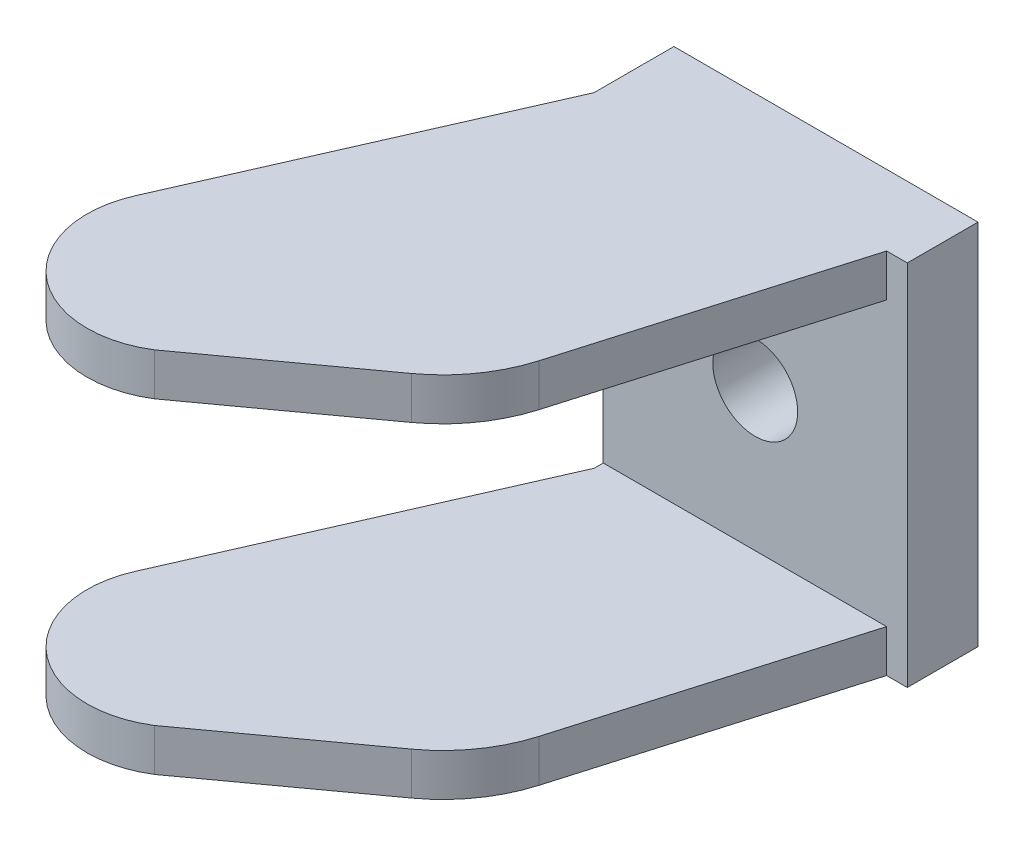
ISO-10303-21;
HEADER;
FILE_DESCRIPTION(('STEP AP214'),'2;1');
FILE_NAME('part.step','',(''),(''),'','','');
FILE_SCHEMA(('AUTOMOTIVE_DESIGN { 1 0 10303 214 1 1 1 1 }'));
ENDSEC;
DATA;
#1=APPLICATION_CONTEXT('core data for automotive mechanical design processes');
#2=APPLICATION_PROTOCOL_DEFINITION('international standard','automotive_design',2000,#1);
#3=PRODUCT_CONTEXT('',#1,'mechanical');
#4=PRODUCT('Part','Part','',(#3));
#5=PRODUCT_RELATED_PRODUCT_CATEGORY('part','',(#4));
#6=PRODUCT_DEFINITION_FORMATION('','',#4);
#7=PRODUCT_DEFINITION_CONTEXT('part definition',#1,'design');
#8=PRODUCT_DEFINITION('design','',#6,#7);
#9=PRODUCT_DEFINITION_SHAPE('','',#8);
#10=(LENGTH_UNIT() NAMED_UNIT(*) SI_UNIT(.MILLI.,.METRE.));
#11=(NAMED_UNIT(*) PLANE_ANGLE_UNIT() SI_UNIT($,.RADIAN.));
#12=(NAMED_UNIT(*) SI_UNIT($,.STERADIAN.) SOLID_ANGLE_UNIT());
#13=UNCERTAINTY_MEASURE_WITH_UNIT(LENGTH_MEASURE(1.E-05),#10,'distance_accuracy_value','');
#14=(GEOMETRIC_REPRESENTATION_CONTEXT(3) GLOBAL_UNCERTAINTY_ASSIGNED_CONTEXT((#13)) GLOBAL_UNIT_ASSIGNED_CONTEXT((#10,
#11,#12)) REPRESENTATION_CONTEXT('',''));
#15=CARTESIAN_POINT('',(0.,0.,0.));
#16=DIRECTION('',(0.,0.,1.));
#17=DIRECTION('',(1.,0.,0.));
#18=AXIS2_PLACEMENT_3D('',#15,#16,#17);
#19=CARTESIAN_POINT('',(0.,0.,5.));
#20=DIRECTION('',(0.,0.,-1.));
#21=DIRECTION('',(-1.,0.,0.));
#22=AXIS2_PLACEMENT_3D('',#19,#20,#21);
#23=PLANE('',#22);
#24=CARTESIAN_POINT('',(10.75,0.,5.));
#25=DIRECTION('',(0.,0.,-1.));
#26=DIRECTION('',(-1.,0.,0.));
#27=AXIS2_PLACEMENT_3D('',#24,#25,#26);
#28=CIRCLE('',#27,3.);
#29=CARTESIAN_POINT('',(7.75,0.,5.));
#30=VERTEX_POINT('',#29);
#31=EDGE_CURVE('E153',#30,#30,#28,.T.);
#32=ORIENTED_EDGE('',*,*,#31,.T.);
#33=EDGE_LOOP('',(#32));
#34=FACE_BOUND('',#33,.T.);
#35=DIRECTION('',(0.,1.,0.));
#36=VECTOR('',#35,1.);
#37=CARTESIAN_POINT('',(20.0357289784233,0.,5.));
#38=LINE('',#37,#36);
#39=CARTESIAN_POINT('',(20.0357289784233,10.,5.));
#40=VERTEX_POINT('',#39);
#41=CARTESIAN_POINT('',(20.0357289784233,13.,5.));
#42=VERTEX_POINT('',#41);
#43=EDGE_CURVE('E166',#40,#42,#38,.T.);
#44=ORIENTED_EDGE('',*,*,#43,.F.);
#45=DIRECTION('',(-1.,0.,0.));
#46=VECTOR('',#45,1.);
#47=CARTESIAN_POINT('',(0.,10.,5.));
#48=LINE('',#47,#46);
#49=CARTESIAN_POINT('',(0.,9.99999999999999,5.));
#50=VERTEX_POINT('',#49);
#51=EDGE_CURVE('E169',#40,#50,#48,.T.);
#52=ORIENTED_EDGE('',*,*,#51,.T.);
#53=DIRECTION('',(0.,1.,0.));
#54=VECTOR('',#53,1.);
#55=CARTESIAN_POINT('',(0.,-13.,5.));
#56=LINE('',#55,#54);
#57=CARTESIAN_POINT('',(0.,-10.,5.));
#58=VERTEX_POINT('',#57);
#59=EDGE_CURVE('E151',#58,#50,#56,.T.);
#60=ORIENTED_EDGE('',*,*,#59,.F.);
#61=DIRECTION('',(1.,0.,0.));
#62=VECTOR('',#61,1.);
#63=CARTESIAN_POINT('',(4.87079094798598,-10.,5.));
#64=LINE('',#63,#62);
#65=CARTESIAN_POINT('',(20.0357289784233,-10.,5.));
#66=VERTEX_POINT('',#65);
#67=EDGE_CURVE('E11',#58,#66,#64,.T.);
#68=ORIENTED_EDGE('',*,*,#67,.T.);
#69=DIRECTION('',(0.,-1.,0.));
#70=VECTOR('',#69,1.);
#71=CARTESIAN_POINT('',(20.0357289784233,13.,5.));
#72=LINE('',#71,#70);
#73=CARTESIAN_POINT('',(20.0357289784233,-13.,5.));
#74=VERTEX_POINT('',#73);
#75=EDGE_CURVE('E192',#66,#74,#72,.T.);
#76=ORIENTED_EDGE('',*,*,#75,.T.);
#77=DIRECTION('',(-1.,0.,0.));
#78=VECTOR('',#77,1.);
#79=CARTESIAN_POINT('',(0.,-13.,5.));
#80=LINE('',#79,#78);
#81=CARTESIAN_POINT('',(21.5,-13.,5.));
#82=VERTEX_POINT('',#81);
#83=EDGE_CURVE('E183',#82,#74,#80,.T.);
#84=ORIENTED_EDGE('',*,*,#83,.F.);
#85=DIRECTION('',(0.,-1.,0.));
#86=VECTOR('',#85,1.);
#87=CARTESIAN_POINT('',(21.5,-13.,5.));
#88=LINE('',#87,#86);
#89=CARTESIAN_POINT('',(21.5,13.,5.));
#90=VERTEX_POINT('',#89);
#91=EDGE_CURVE('E180',#90,#82,#88,.T.);
#92=ORIENTED_EDGE('',*,*,#91,.F.);
#93=DIRECTION('',(1.,0.,0.));
#94=VECTOR('',#93,1.);
#95=CARTESIAN_POINT('',(0.,13.,5.));
#96=LINE('',#95,#94);
#97=EDGE_CURVE('E178',#42,#90,#96,.T.);
#98=ORIENTED_EDGE('',*,*,#97,.F.);
#99=EDGE_LOOP('',(#44,#52,#60,#68,#76,#84,#92,#98));
#100=FACE_BOUND('',#99,.T.);
#101=ADVANCED_FACE('F33',(#34,#100),#23,.F.);
#102=CARTESIAN_POINT('',(21.5,13.,0.));
#103=DIRECTION('',(-0.959693081685754,0.,-0.281050153824011));
#104=DIRECTION('',(-0.281050153824011,0.,0.959693081685754));
#105=AXIS2_PLACEMENT_3D('',#102,#103,#104);
#106=PLANE('',#105);
#107=ORIENTED_EDGE('',*,*,#75,.F.);
#108=DIRECTION('',(0.281050153824011,0.,-0.959693081685754));
#109=VECTOR('',#108,1.);
#110=CARTESIAN_POINT('',(21.5,-10.,0.));
#111=LINE('',#110,#109);
#112=CARTESIAN_POINT('',(14.4677217648435,-10.,24.0128983348466));
#113=VERTEX_POINT('',#112);
#114=EDGE_CURVE('E41',#113,#66,#111,.T.);
#115=ORIENTED_EDGE('',*,*,#114,.F.);
#116=DIRECTION('',(0.,-1.,0.));
#117=VECTOR('',#116,1.);
#118=CARTESIAN_POINT('',(14.4677217648435,13.,24.0128983348466));
#119=LINE('',#118,#117);
#120=CARTESIAN_POINT('',(14.4677217648435,-13.,24.0128983348466));
#121=VERTEX_POINT('',#120);
#122=EDGE_CURVE('E205',#113,#121,#119,.T.);
#123=ORIENTED_EDGE('',*,*,#122,.T.);
#124=DIRECTION('',(0.281050153824011,0.,-0.959693081685754));
#125=VECTOR('',#124,1.);
#126=CARTESIAN_POINT('',(21.5,-13.,0.));
#127=LINE('',#126,#125);
#128=EDGE_CURVE('E56',#121,#74,#127,.T.);
#129=ORIENTED_EDGE('',*,*,#128,.T.);
#130=EDGE_LOOP('',(#107,#115,#123,#129));
#131=FACE_BOUND('',#130,.T.);
#132=ADVANCED_FACE('F325',(#131),#106,.F.);
#133=CARTESIAN_POINT('',(4.87079094798598,-10.,21.2023967966065));
#134=DIRECTION('',(0.,-1.,0.));
#135=DIRECTION('',(0.,0.,-1.));
#136=AXIS2_PLACEMENT_3D('',#133,#134,#135);
#137=PLANE('',#136);
#138=ORIENTED_EDGE('',*,*,#67,.F.);
#139=DIRECTION('',(0.,0.,1.));
#140=VECTOR('',#139,1.);
#141=CARTESIAN_POINT('',(0.,-10.,5.6494442047383));
#142=LINE('',#141,#140);
#143=CARTESIAN_POINT('',(0.,-10.,5.6494442047383));
#144=VERTEX_POINT('',#143);
#145=EDGE_CURVE('E202',#58,#144,#142,.T.);
#146=ORIENTED_EDGE('',*,*,#145,.T.);
#147=DIRECTION('',(-0.402513806205411,0.,0.915413915020977));
#148=VECTOR('',#147,1.);
#149=CARTESIAN_POINT('',(-9.90789740514684,-10.,28.1824033565621));
#150=LINE('',#149,#148);
#151=CARTESIAN_POINT('',(-9.90789740514684,-10.,28.1824033565621));
#152=VERTEX_POINT('',#151);
#153=EDGE_CURVE('E232',#144,#152,#150,.T.);
#154=ORIENTED_EDGE('',*,*,#153,.T.);
#155=CARTESIAN_POINT('',(-3.5,-10.,31.));
#156=DIRECTION('',(0.,1.,0.));
#157=DIRECTION('',(0.,0.,1.));
#158=AXIS2_PLACEMENT_3D('',#155,#156,#157);
#159=CIRCLE('',#158,7.);
#160=CARTESIAN_POINT('',(0.209992580022254,-10.,36.9359881280356));
#161=VERTEX_POINT('',#160);
#162=EDGE_CURVE('E230',#152,#161,#159,.T.);
#163=ORIENTED_EDGE('',*,*,#162,.T.);
#164=DIRECTION('',(0.80950474651875,0.,-0.587113332639972));
#165=VECTOR('',#164,1.);
#166=CARTESIAN_POINT('',(10.7419242743857,-10.,29.297444261794));
#167=LINE('',#166,#165);
#168=CARTESIAN_POINT('',(10.7419242743857,-10.,29.297444261794));
#169=VERTEX_POINT('',#168);
#170=EDGE_CURVE('E228',#161,#169,#167,.T.);
#171=ORIENTED_EDGE('',*,*,#170,.T.);
#172=CARTESIAN_POINT('',(4.87079094798598,-10.,21.2023967966065));
#173=DIRECTION('',(0.,1.,0.));
#174=DIRECTION('',(0.,0.,-1.));
#175=AXIS2_PLACEMENT_3D('',#172,#173,#174);
#176=CIRCLE('',#175,10.);
#177=EDGE_CURVE('E226',#169,#113,#176,.T.);
#178=ORIENTED_EDGE('',*,*,#177,.T.);
#179=ORIENTED_EDGE('',*,*,#114,.T.);
#180=EDGE_LOOP('',(#138,#146,#154,#163,#171,#178,#179));
#181=FACE_BOUND('',#180,.T.);
#182=ADVANCED_FACE('F332',(#181),#137,.F.);
#183=CARTESIAN_POINT('',(0.,13.,5.6494442047383));
#184=DIRECTION('',(1.,0.,0.));
#185=DIRECTION('',(0.,0.,-1.));
#186=AXIS2_PLACEMENT_3D('',#183,#184,#185);
#187=PLANE('',#186);
#188=ORIENTED_EDGE('',*,*,#59,.T.);
#189=DIRECTION('',(0.,0.,1.));
#190=VECTOR('',#189,1.);
#191=CARTESIAN_POINT('',(0.,10.,5.6494442047383));
#192=LINE('',#191,#190);
#193=CARTESIAN_POINT('',(0.,10.,5.6494442047383));
#194=VERTEX_POINT('',#193);
#195=EDGE_CURVE('E48',#50,#194,#192,.T.);
#196=ORIENTED_EDGE('',*,*,#195,.T.);
#197=DIRECTION('',(0.,-1.,0.));
#198=VECTOR('',#197,1.);
#199=CARTESIAN_POINT('',(0.,13.,5.6494442047383));
#200=LINE('',#199,#198);
#201=CARTESIAN_POINT('',(0.,13.,5.6494442047383));
#202=VERTEX_POINT('',#201);
#203=EDGE_CURVE('E148',#202,#194,#200,.T.);
#204=ORIENTED_EDGE('',*,*,#203,.F.);
#205=DIRECTION('',(0.,0.,-1.));
#206=VECTOR('',#205,1.);
#207=CARTESIAN_POINT('',(0.,13.,5.));
#208=LINE('',#207,#206);
#209=CARTESIAN_POINT('',(0.,13.,0.));
#210=VERTEX_POINT('',#209);
#211=EDGE_CURVE('E186',#202,#210,#208,.T.);
#212=ORIENTED_EDGE('',*,*,#211,.T.);
#213=DIRECTION('',(0.,-1.,0.));
#214=VECTOR('',#213,1.);
#215=CARTESIAN_POINT('',(0.,13.,0.));
#216=LINE('',#215,#214);
#217=CARTESIAN_POINT('',(0.,-13.,0.));
#218=VERTEX_POINT('',#217);
#219=EDGE_CURVE('E198',#210,#218,#216,.T.);
#220=ORIENTED_EDGE('',*,*,#219,.T.);
#221=DIRECTION('',(0.,0.,1.));
#222=VECTOR('',#221,1.);
#223=CARTESIAN_POINT('',(0.,-13.,5.6494442047383));
#224=LINE('',#223,#222);
#225=CARTESIAN_POINT('',(0.,-13.,5.6494442047383));
#226=VERTEX_POINT('',#225);
#227=EDGE_CURVE('E222',#218,#226,#224,.T.);
#228=ORIENTED_EDGE('',*,*,#227,.T.);
#229=DIRECTION('',(0.,-1.,0.));
#230=VECTOR('',#229,1.);
#231=CARTESIAN_POINT('',(0.,13.,5.6494442047383));
#232=LINE('',#231,#230);
#233=EDGE_CURVE('E221',#144,#226,#232,.T.);
#234=ORIENTED_EDGE('',*,*,#233,.F.);
#235=ORIENTED_EDGE('',*,*,#145,.F.);
#236=EDGE_LOOP('',(#188,#196,#204,#212,#220,#228,#234,#235));
#237=FACE_BOUND('',#236,.T.);
#238=ADVANCED_FACE('F35',(#237),#187,.F.);
#239=CARTESIAN_POINT('',(-9.90789740514684,13.,28.1824033565621));
#240=DIRECTION('',(0.915413915020977,0.,0.402513806205411));
#241=DIRECTION('',(0.402513806205411,0.,-0.915413915020977));
#242=AXIS2_PLACEMENT_3D('',#239,#240,#241);
#243=PLANE('',#242);
#244=DIRECTION('',(0.,-1.,0.));
#245=VECTOR('',#244,1.);
#246=CARTESIAN_POINT('',(-9.90789740514684,13.,28.1824033565621));
#247=LINE('',#246,#245);
#248=CARTESIAN_POINT('',(-9.90789740514684,-13.,28.1824033565621));
#249=VERTEX_POINT('',#248);
#250=EDGE_CURVE('E217',#152,#249,#247,.T.);
#251=ORIENTED_EDGE('',*,*,#250,.F.);
#252=ORIENTED_EDGE('',*,*,#153,.F.);
#253=ORIENTED_EDGE('',*,*,#233,.T.);
#254=DIRECTION('',(-0.402513806205411,0.,0.915413915020977));
#255=VECTOR('',#254,1.);
#256=CARTESIAN_POINT('',(-9.90789740514684,-13.,28.1824033565621));
#257=LINE('',#256,#255);
#258=EDGE_CURVE('E218',#226,#249,#257,.T.);
#259=ORIENTED_EDGE('',*,*,#258,.T.);
#260=EDGE_LOOP('',(#251,#252,#253,#259));
#261=FACE_BOUND('',#260,.T.);
#262=ADVANCED_FACE('F254',(#261),#243,.F.);
#263=CARTESIAN_POINT('',(-3.5,13.,31.));
#264=DIRECTION('',(0.,-1.,0.));
#265=DIRECTION('',(0.,0.,-1.));
#266=AXIS2_PLACEMENT_3D('',#263,#264,#265);
#267=CYLINDRICAL_SURFACE('',#266,7.);
#268=DIRECTION('',(0.,-1.,0.));
#269=VECTOR('',#268,1.);
#270=CARTESIAN_POINT('',(0.209992580022254,13.,36.9359881280356));
#271=LINE('',#270,#269);
#272=CARTESIAN_POINT('',(0.209992580022254,-13.,36.9359881280356));
#273=VERTEX_POINT('',#272);
#274=EDGE_CURVE('E213',#161,#273,#271,.T.);
#275=ORIENTED_EDGE('',*,*,#274,.F.);
#276=ORIENTED_EDGE('',*,*,#162,.F.);
#277=ORIENTED_EDGE('',*,*,#250,.T.);
#278=CARTESIAN_POINT('',(-3.5,-13.,31.));
#279=DIRECTION('',(0.,1.,0.));
#280=DIRECTION('',(0.,0.,1.));
#281=AXIS2_PLACEMENT_3D('',#278,#279,#280);
#282=CIRCLE('',#281,7.);
#283=EDGE_CURVE('E214',#249,#273,#282,.T.);
#284=ORIENTED_EDGE('',*,*,#283,.T.);
#285=EDGE_LOOP('',(#275,#276,#277,#284));
#286=FACE_BOUND('',#285,.T.);
#287=ADVANCED_FACE('F471',(#286),#267,.T.);
#288=CARTESIAN_POINT('',(10.7419242743857,13.,29.297444261794));
#289=DIRECTION('',(-0.587113332639972,0.,-0.80950474651875));
#290=DIRECTION('',(-0.80950474651875,0.,0.587113332639972));
#291=AXIS2_PLACEMENT_3D('',#288,#289,#290);
#292=PLANE('',#291);
#293=DIRECTION('',(0.,-1.,0.));
#294=VECTOR('',#293,1.);
#295=CARTESIAN_POINT('',(10.7419242743857,13.,29.297444261794));
#296=LINE('',#295,#294);
#297=CARTESIAN_POINT('',(10.7419242743857,-13.,29.297444261794));
#298=VERTEX_POINT('',#297);
#299=EDGE_CURVE('E209',#169,#298,#296,.T.);
#300=ORIENTED_EDGE('',*,*,#299,.F.);
#301=ORIENTED_EDGE('',*,*,#170,.F.);
#302=ORIENTED_EDGE('',*,*,#274,.T.);
#303=DIRECTION('',(0.80950474651875,0.,-0.587113332639972));
#304=VECTOR('',#303,1.);
#305=CARTESIAN_POINT('',(10.7419242743857,-13.,29.297444261794));
#306=LINE('',#305,#304);
#307=EDGE_CURVE('E210',#273,#298,#306,.T.);
#308=ORIENTED_EDGE('',*,*,#307,.T.);
#309=EDGE_LOOP('',(#300,#301,#302,#308));
#310=FACE_BOUND('',#309,.T.);
#311=ADVANCED_FACE('F320',(#310),#292,.F.);
#312=CARTESIAN_POINT('',(4.87079094798598,13.,21.2023967966065));
#313=DIRECTION('',(0.,-1.,0.));
#314=DIRECTION('',(0.,0.,-1.));
#315=AXIS2_PLACEMENT_3D('',#312,#313,#314);
#316=CYLINDRICAL_SURFACE('',#315,10.);
#317=ORIENTED_EDGE('',*,*,#122,.F.);
#318=ORIENTED_EDGE('',*,*,#177,.F.);
#319=ORIENTED_EDGE('',*,*,#299,.T.);
#320=CARTESIAN_POINT('',(4.87079094798598,-13.,21.2023967966065));
#321=DIRECTION('',(0.,1.,0.));
#322=DIRECTION('',(0.,0.,-1.));
#323=AXIS2_PLACEMENT_3D('',#320,#321,#322);
#324=CIRCLE('',#323,10.);
#325=EDGE_CURVE('E206',#298,#121,#324,.T.);
#326=ORIENTED_EDGE('',*,*,#325,.T.);
#327=EDGE_LOOP('',(#317,#318,#319,#326));
#328=FACE_BOUND('',#327,.T.);
#329=ADVANCED_FACE('F310',(#328),#316,.T.);
#330=CARTESIAN_POINT('',(0.,13.,0.));
#331=DIRECTION('',(0.,0.,1.));
#332=DIRECTION('',(1.,0.,0.));
#333=AXIS2_PLACEMENT_3D('',#330,#331,#332);
#334=PLANE('',#333);
#335=CARTESIAN_POINT('',(10.75,0.,0.));
#336=DIRECTION('',(0.,0.,-1.));
#337=DIRECTION('',(-1.,0.,0.));
#338=AXIS2_PLACEMENT_3D('',#335,#336,#337);
#339=CIRCLE('',#338,3.);
#340=CARTESIAN_POINT('',(7.75,0.,0.));
#341=VERTEX_POINT('',#340);
#342=EDGE_CURVE('E302',#341,#341,#339,.T.);
#343=ORIENTED_EDGE('',*,*,#342,.F.);
#344=EDGE_LOOP('',(#343));
#345=FACE_BOUND('',#344,.T.);
#346=DIRECTION('',(-1.,0.,0.));
#347=VECTOR('',#346,1.);
#348=CARTESIAN_POINT('',(0.,-13.,0.));
#349=LINE('',#348,#347);
#350=CARTESIAN_POINT('',(21.5,-13.,0.));
#351=VERTEX_POINT('',#350);
#352=EDGE_CURVE('E199',#351,#218,#349,.T.);
#353=ORIENTED_EDGE('',*,*,#352,.T.);
#354=ORIENTED_EDGE('',*,*,#219,.F.);
#355=DIRECTION('',(1.,0.,0.));
#356=VECTOR('',#355,1.);
#357=CARTESIAN_POINT('',(0.,13.,0.));
#358=LINE('',#357,#356);
#359=CARTESIAN_POINT('',(21.5,13.,0.));
#360=VERTEX_POINT('',#359);
#361=EDGE_CURVE('E176',#210,#360,#358,.T.);
#362=ORIENTED_EDGE('',*,*,#361,.T.);
#363=DIRECTION('',(0.,-1.,0.));
#364=VECTOR('',#363,1.);
#365=CARTESIAN_POINT('',(21.5,13.,0.));
#366=LINE('',#365,#364);
#367=EDGE_CURVE('E203',#360,#351,#366,.T.);
#368=ORIENTED_EDGE('',*,*,#367,.T.);
#369=EDGE_LOOP('',(#353,#354,#362,#368));
#370=FACE_BOUND('',#369,.T.);
#371=ADVANCED_FACE('F246',(#345,#370),#334,.F.);
#372=CARTESIAN_POINT('',(4.87079094798598,-13.,21.2023967966065));
#373=DIRECTION('',(0.,-1.,0.));
#374=DIRECTION('',(0.,0.,-1.));
#375=AXIS2_PLACEMENT_3D('',#372,#373,#374);
#376=PLANE('',#375);
#377=ORIENTED_EDGE('',*,*,#352,.F.);
#378=DIRECTION('',(0.,0.,-1.));
#379=VECTOR('',#378,1.);
#380=CARTESIAN_POINT('',(21.5,-13.,5.));
#381=LINE('',#380,#379);
#382=EDGE_CURVE('E189',#82,#351,#381,.T.);
#383=ORIENTED_EDGE('',*,*,#382,.F.);
#384=ORIENTED_EDGE('',*,*,#83,.T.);
#385=ORIENTED_EDGE('',*,*,#128,.F.);
#386=ORIENTED_EDGE('',*,*,#325,.F.);
#387=ORIENTED_EDGE('',*,*,#307,.F.);
#388=ORIENTED_EDGE('',*,*,#283,.F.);
#389=ORIENTED_EDGE('',*,*,#258,.F.);
#390=ORIENTED_EDGE('',*,*,#227,.F.);
#391=EDGE_LOOP('',(#377,#383,#384,#385,#386,#387,#388,#389,#390));
#392=FACE_BOUND('',#391,.T.);
#393=ADVANCED_FACE('F249',(#392),#376,.T.);
#394=CARTESIAN_POINT('',(21.5,-13.,5.));
#395=DIRECTION('',(1.,0.,0.));
#396=DIRECTION('',(0.,0.,-1.));
#397=AXIS2_PLACEMENT_3D('',#394,#395,#396);
#398=PLANE('',#397);
#399=ORIENTED_EDGE('',*,*,#367,.F.);
#400=DIRECTION('',(0.,0.,-1.));
#401=VECTOR('',#400,1.);
#402=CARTESIAN_POINT('',(21.5,13.,5.));
#403=LINE('',#402,#401);
#404=EDGE_CURVE('E193',#90,#360,#403,.T.);
#405=ORIENTED_EDGE('',*,*,#404,.F.);
#406=ORIENTED_EDGE('',*,*,#91,.T.);
#407=ORIENTED_EDGE('',*,*,#382,.T.);
#408=EDGE_LOOP('',(#399,#405,#406,#407));
#409=FACE_BOUND('',#408,.T.);
#410=ADVANCED_FACE('F317',(#409),#398,.T.);
#411=CARTESIAN_POINT('',(0.,13.,5.));
#412=DIRECTION('',(0.,1.,0.));
#413=DIRECTION('',(0.,0.,1.));
#414=AXIS2_PLACEMENT_3D('',#411,#412,#413);
#415=PLANE('',#414);
#416=ORIENTED_EDGE('',*,*,#211,.F.);
#417=DIRECTION('',(-0.402513806205411,0.,0.915413915020977));
#418=VECTOR('',#417,1.);
#419=CARTESIAN_POINT('',(-9.90789740514684,13.,28.1824033565621));
#420=LINE('',#419,#418);
#421=CARTESIAN_POINT('',(-9.90789740514684,13.,28.1824033565621));
#422=VERTEX_POINT('',#421);
#423=EDGE_CURVE('E165',#202,#422,#420,.T.);
#424=ORIENTED_EDGE('',*,*,#423,.T.);
#425=CARTESIAN_POINT('',(-3.5,13.,31.));
#426=DIRECTION('',(0.,1.,0.));
#427=DIRECTION('',(0.,0.,1.));
#428=AXIS2_PLACEMENT_3D('',#425,#426,#427);
#429=CIRCLE('',#428,7.);
#430=CARTESIAN_POINT('',(0.209992580022254,13.,36.9359881280356));
#431=VERTEX_POINT('',#430);
#432=EDGE_CURVE('E272',#422,#431,#429,.T.);
#433=ORIENTED_EDGE('',*,*,#432,.T.);
#434=DIRECTION('',(0.80950474651875,0.,-0.587113332639972));
#435=VECTOR('',#434,1.);
#436=CARTESIAN_POINT('',(10.7419242743857,13.,29.297444261794));
#437=LINE('',#436,#435);
#438=CARTESIAN_POINT('',(10.7419242743857,13.,29.297444261794));
#439=VERTEX_POINT('',#438);
#440=EDGE_CURVE('E279',#431,#439,#437,.T.);
#441=ORIENTED_EDGE('',*,*,#440,.T.);
#442=CARTESIAN_POINT('',(4.87079094798598,13.,21.2023967966065));
#443=DIRECTION('',(0.,1.,0.));
#444=DIRECTION('',(0.,0.,-1.));
#445=AXIS2_PLACEMENT_3D('',#442,#443,#444);
#446=CIRCLE('',#445,10.);
#447=CARTESIAN_POINT('',(14.4677217648435,13.,24.0128983348466));
#448=VERTEX_POINT('',#447);
#449=EDGE_CURVE('E281',#439,#448,#446,.T.);
#450=ORIENTED_EDGE('',*,*,#449,.T.);
#451=DIRECTION('',(0.281050153824011,0.,-0.959693081685754));
#452=VECTOR('',#451,1.);
#453=CARTESIAN_POINT('',(21.5,13.,0.));
#454=LINE('',#453,#452);
#455=EDGE_CURVE('E283',#448,#42,#454,.T.);
#456=ORIENTED_EDGE('',*,*,#455,.T.);
#457=ORIENTED_EDGE('',*,*,#97,.T.);
#458=ORIENTED_EDGE('',*,*,#404,.T.);
#459=ORIENTED_EDGE('',*,*,#361,.F.);
#460=EDGE_LOOP('',(#416,#424,#433,#441,#450,#456,#457,#458,#459));
#461=FACE_BOUND('',#460,.T.);
#462=ADVANCED_FACE('F338',(#461),#415,.T.);
#463=CARTESIAN_POINT('',(4.87079094798598,10.,21.2023967966065));
#464=DIRECTION('',(0.,-1.,0.));
#465=DIRECTION('',(0.,0.,-1.));
#466=AXIS2_PLACEMENT_3D('',#463,#464,#465);
#467=PLANE('',#466);
#468=ORIENTED_EDGE('',*,*,#51,.F.);
#469=DIRECTION('',(0.281050153824011,0.,-0.959693081685754));
#470=VECTOR('',#469,1.);
#471=CARTESIAN_POINT('',(21.5,10.,0.));
#472=LINE('',#471,#470);
#473=CARTESIAN_POINT('',(14.4677217648435,10.,24.0128983348466));
#474=VERTEX_POINT('',#473);
#475=EDGE_CURVE('E261',#474,#40,#472,.T.);
#476=ORIENTED_EDGE('',*,*,#475,.F.);
#477=CARTESIAN_POINT('',(4.87079094798598,10.,21.2023967966065));
#478=DIRECTION('',(0.,1.,0.));
#479=DIRECTION('',(0.,0.,-1.));
#480=AXIS2_PLACEMENT_3D('',#477,#478,#479);
#481=CIRCLE('',#480,10.);
#482=CARTESIAN_POINT('',(10.7419242743857,10.,29.297444261794));
#483=VERTEX_POINT('',#482);
#484=EDGE_CURVE('E270',#483,#474,#481,.T.);
#485=ORIENTED_EDGE('',*,*,#484,.F.);
#486=DIRECTION('',(0.80950474651875,0.,-0.587113332639972));
#487=VECTOR('',#486,1.);
#488=CARTESIAN_POINT('',(10.7419242743857,10.,29.297444261794));
#489=LINE('',#488,#487);
#490=CARTESIAN_POINT('',(0.209992580022254,10.,36.9359881280356));
#491=VERTEX_POINT('',#490);
#492=EDGE_CURVE('E274',#491,#483,#489,.T.);
#493=ORIENTED_EDGE('',*,*,#492,.F.);
#494=CARTESIAN_POINT('',(-3.5,10.,31.));
#495=DIRECTION('',(0.,1.,0.));
#496=DIRECTION('',(0.,0.,1.));
#497=AXIS2_PLACEMENT_3D('',#494,#495,#496);
#498=CIRCLE('',#497,7.);
#499=CARTESIAN_POINT('',(-9.90789740514684,10.,28.1824033565621));
#500=VERTEX_POINT('',#499);
#501=EDGE_CURVE('E158',#500,#491,#498,.T.);
#502=ORIENTED_EDGE('',*,*,#501,.F.);
#503=DIRECTION('',(-0.402513806205411,0.,0.915413915020977));
#504=VECTOR('',#503,1.);
#505=CARTESIAN_POINT('',(-9.90789740514684,10.,28.1824033565621));
#506=LINE('',#505,#504);
#507=EDGE_CURVE('E152',#194,#500,#506,.T.);
#508=ORIENTED_EDGE('',*,*,#507,.F.);
#509=ORIENTED_EDGE('',*,*,#195,.F.);
#510=EDGE_LOOP('',(#468,#476,#485,#493,#502,#508,#509));
#511=FACE_BOUND('',#510,.T.);
#512=ADVANCED_FACE('F156',(#511),#467,.T.);
#513=CARTESIAN_POINT('',(21.5,13.,0.));
#514=DIRECTION('',(-0.959693081685754,0.,-0.281050153824011));
#515=DIRECTION('',(-0.281050153824011,0.,0.959693081685754));
#516=AXIS2_PLACEMENT_3D('',#513,#514,#515);
#517=PLANE('',#516);
#518=ORIENTED_EDGE('',*,*,#475,.T.);
#519=ORIENTED_EDGE('',*,*,#43,.T.);
#520=ORIENTED_EDGE('',*,*,#455,.F.);
#521=DIRECTION('',(0.,-1.,0.));
#522=VECTOR('',#521,1.);
#523=CARTESIAN_POINT('',(14.4677217648435,13.,24.0128983348466));
#524=LINE('',#523,#522);
#525=EDGE_CURVE('E269',#448,#474,#524,.T.);
#526=ORIENTED_EDGE('',*,*,#525,.T.);
#527=EDGE_LOOP('',(#518,#519,#520,#526));
#528=FACE_BOUND('',#527,.T.);
#529=ADVANCED_FACE('F265',(#528),#517,.F.);
#530=CARTESIAN_POINT('',(4.87079094798598,13.,21.2023967966065));
#531=DIRECTION('',(0.,-1.,0.));
#532=DIRECTION('',(0.,0.,-1.));
#533=AXIS2_PLACEMENT_3D('',#530,#531,#532);
#534=CYLINDRICAL_SURFACE('',#533,10.);
#535=ORIENTED_EDGE('',*,*,#484,.T.);
#536=ORIENTED_EDGE('',*,*,#525,.F.);
#537=ORIENTED_EDGE('',*,*,#449,.F.);
#538=DIRECTION('',(0.,-1.,0.));
#539=VECTOR('',#538,1.);
#540=CARTESIAN_POINT('',(10.7419242743857,13.,29.297444261794));
#541=LINE('',#540,#539);
#542=EDGE_CURVE('E286',#439,#483,#541,.T.);
#543=ORIENTED_EDGE('',*,*,#542,.T.);
#544=EDGE_LOOP('',(#535,#536,#537,#543));
#545=FACE_BOUND('',#544,.T.);
#546=ADVANCED_FACE('F356',(#545),#534,.T.);
#547=CARTESIAN_POINT('',(10.7419242743857,13.,29.297444261794));
#548=DIRECTION('',(-0.587113332639972,0.,-0.80950474651875));
#549=DIRECTION('',(-0.80950474651875,0.,0.587113332639972));
#550=AXIS2_PLACEMENT_3D('',#547,#548,#549);
#551=PLANE('',#550);
#552=ORIENTED_EDGE('',*,*,#492,.T.);
#553=ORIENTED_EDGE('',*,*,#542,.F.);
#554=ORIENTED_EDGE('',*,*,#440,.F.);
#555=DIRECTION('',(0.,-1.,0.));
#556=VECTOR('',#555,1.);
#557=CARTESIAN_POINT('',(0.209992580022254,13.,36.9359881280356));
#558=LINE('',#557,#556);
#559=EDGE_CURVE('E171',#431,#491,#558,.T.);
#560=ORIENTED_EDGE('',*,*,#559,.T.);
#561=EDGE_LOOP('',(#552,#553,#554,#560));
#562=FACE_BOUND('',#561,.T.);
#563=ADVANCED_FACE('F293',(#562),#551,.F.);
#564=CARTESIAN_POINT('',(-3.5,13.,31.));
#565=DIRECTION('',(0.,-1.,0.));
#566=DIRECTION('',(0.,0.,-1.));
#567=AXIS2_PLACEMENT_3D('',#564,#565,#566);
#568=CYLINDRICAL_SURFACE('',#567,7.);
#569=ORIENTED_EDGE('',*,*,#501,.T.);
#570=ORIENTED_EDGE('',*,*,#559,.F.);
#571=ORIENTED_EDGE('',*,*,#432,.F.);
#572=DIRECTION('',(0.,-1.,0.));
#573=VECTOR('',#572,1.);
#574=CARTESIAN_POINT('',(-9.90789740514684,13.,28.1824033565621));
#575=LINE('',#574,#573);
#576=EDGE_CURVE('E167',#422,#500,#575,.T.);
#577=ORIENTED_EDGE('',*,*,#576,.T.);
#578=EDGE_LOOP('',(#569,#570,#571,#577));
#579=FACE_BOUND('',#578,.T.);
#580=ADVANCED_FACE('F297',(#579),#568,.T.);
#581=CARTESIAN_POINT('',(-9.90789740514684,13.,28.1824033565621));
#582=DIRECTION('',(0.915413915020977,0.,0.402513806205411));
#583=DIRECTION('',(0.402513806205411,0.,-0.915413915020977));
#584=AXIS2_PLACEMENT_3D('',#581,#582,#583);
#585=PLANE('',#584);
#586=ORIENTED_EDGE('',*,*,#507,.T.);
#587=ORIENTED_EDGE('',*,*,#576,.F.);
#588=ORIENTED_EDGE('',*,*,#423,.F.);
#589=ORIENTED_EDGE('',*,*,#203,.T.);
#590=EDGE_LOOP('',(#586,#587,#588,#589));
#591=FACE_BOUND('',#590,.T.);
#592=ADVANCED_FACE('F164',(#591),#585,.F.);
#593=CARTESIAN_POINT('',(10.75,0.,38.));
#594=DIRECTION('',(0.,0.,-1.));
#595=DIRECTION('',(-1.,0.,0.));
#596=AXIS2_PLACEMENT_3D('',#593,#594,#595);
#597=CYLINDRICAL_SURFACE('',#596,3.);
#598=ORIENTED_EDGE('',*,*,#342,.T.);
#599=EDGE_LOOP('',(#598));
#600=FACE_BOUND('',#599,.T.);
#601=ORIENTED_EDGE('',*,*,#31,.F.);
#602=EDGE_LOOP('',(#601));
#603=FACE_BOUND('',#602,.T.);
#604=ADVANCED_FACE('F306',(#600,#603),#597,.F.);
#605=CLOSED_SHELL('',(#101,#132,#182,#238,#262,#287,#311,#329,#371,#393,#410,#462,#512,#529,
#546,#563,#580,#592,#604));
#606=MANIFOLD_SOLID_BREP('B2',#605);
#607=ADVANCED_BREP_SHAPE_REPRESENTATION('',(#18,#606),#14);
#608=SHAPE_DEFINITION_REPRESENTATION(#9,#607);
ENDSEC;
END-ISO-10303-21;
